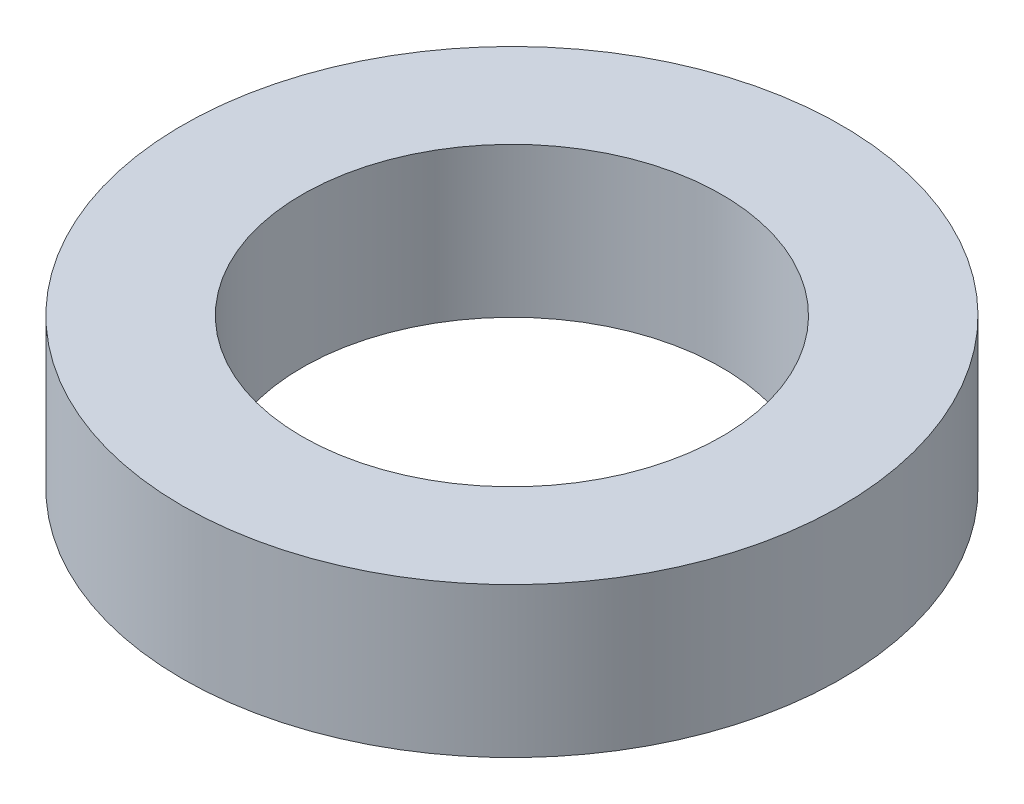
ISO-10303-21;
HEADER;
FILE_DESCRIPTION(('STEP AP214'),'2;1');
FILE_NAME('part.step','',(''),(''),'','','');
FILE_SCHEMA(('AUTOMOTIVE_DESIGN { 1 0 10303 214 1 1 1 1 }'));
ENDSEC;
DATA;
#1=APPLICATION_CONTEXT('core data for automotive mechanical design processes');
#2=APPLICATION_PROTOCOL_DEFINITION('international standard','automotive_design',2000,#1);
#3=PRODUCT_CONTEXT('',#1,'mechanical');
#4=PRODUCT('Part','Part','',(#3));
#5=PRODUCT_RELATED_PRODUCT_CATEGORY('part','',(#4));
#6=PRODUCT_DEFINITION_FORMATION('','',#4);
#7=PRODUCT_DEFINITION_CONTEXT('part definition',#1,'design');
#8=PRODUCT_DEFINITION('design','',#6,#7);
#9=PRODUCT_DEFINITION_SHAPE('','',#8);
#10=(LENGTH_UNIT() NAMED_UNIT(*) SI_UNIT(.MILLI.,.METRE.));
#11=(NAMED_UNIT(*) PLANE_ANGLE_UNIT() SI_UNIT($,.RADIAN.));
#12=(NAMED_UNIT(*) SI_UNIT($,.STERADIAN.) SOLID_ANGLE_UNIT());
#13=UNCERTAINTY_MEASURE_WITH_UNIT(LENGTH_MEASURE(1.E-05),#10,'distance_accuracy_value','');
#14=(GEOMETRIC_REPRESENTATION_CONTEXT(3) GLOBAL_UNCERTAINTY_ASSIGNED_CONTEXT((#13)) GLOBAL_UNIT_ASSIGNED_CONTEXT((#10,
#11,#12)) REPRESENTATION_CONTEXT('',''));
#15=CARTESIAN_POINT('',(0.,0.,0.));
#16=DIRECTION('',(0.,0.,1.));
#17=DIRECTION('',(1.,0.,0.));
#18=AXIS2_PLACEMENT_3D('',#15,#16,#17);
#19=CARTESIAN_POINT('',(0.,2.5,0.));
#20=DIRECTION('',(0.,1.,0.));
#21=DIRECTION('',(0.,0.,1.));
#22=AXIS2_PLACEMENT_3D('',#19,#20,#21);
#23=PLANE('',#22);
#24=CARTESIAN_POINT('',(0.,2.5,0.));
#25=DIRECTION('',(0.,1.,0.));
#26=DIRECTION('',(0.,0.,1.));
#27=AXIS2_PLACEMENT_3D('',#24,#25,#26);
#28=CIRCLE('',#27,5.5);
#29=CARTESIAN_POINT('',(0.,2.5,5.5));
#30=VERTEX_POINT('',#29);
#31=EDGE_CURVE('E10',#30,#30,#28,.T.);
#32=ORIENTED_EDGE('',*,*,#31,.T.);
#33=EDGE_LOOP('',(#32));
#34=FACE_BOUND('',#33,.T.);
#35=CARTESIAN_POINT('',(0.,2.5,0.));
#36=DIRECTION('',(0.,1.,0.));
#37=DIRECTION('',(0.,0.,1.));
#38=AXIS2_PLACEMENT_3D('',#35,#36,#37);
#39=CIRCLE('',#38,3.5);
#40=CARTESIAN_POINT('',(0.,2.5,3.5));
#41=VERTEX_POINT('',#40);
#42=EDGE_CURVE('E50',#41,#41,#39,.T.);
#43=ORIENTED_EDGE('',*,*,#42,.F.);
#44=EDGE_LOOP('',(#43));
#45=FACE_BOUND('',#44,.T.);
#46=ADVANCED_FACE('F37',(#34,#45),#23,.T.);
#47=CARTESIAN_POINT('',(0.,0.,0.));
#48=DIRECTION('',(0.,1.,0.));
#49=DIRECTION('',(0.,0.,1.));
#50=AXIS2_PLACEMENT_3D('',#47,#48,#49);
#51=PLANE('',#50);
#52=CARTESIAN_POINT('',(0.,0.,0.));
#53=DIRECTION('',(0.,1.,0.));
#54=DIRECTION('',(0.,0.,1.));
#55=AXIS2_PLACEMENT_3D('',#52,#53,#54);
#56=CIRCLE('',#55,5.5);
#57=CARTESIAN_POINT('',(0.,0.,5.5));
#58=VERTEX_POINT('',#57);
#59=EDGE_CURVE('E41',#58,#58,#56,.T.);
#60=ORIENTED_EDGE('',*,*,#59,.F.);
#61=EDGE_LOOP('',(#60));
#62=FACE_BOUND('',#61,.T.);
#63=CARTESIAN_POINT('',(0.,0.,0.));
#64=DIRECTION('',(0.,1.,0.));
#65=DIRECTION('',(0.,0.,1.));
#66=AXIS2_PLACEMENT_3D('',#63,#64,#65);
#67=CIRCLE('',#66,3.5);
#68=CARTESIAN_POINT('',(0.,0.,3.5));
#69=VERTEX_POINT('',#68);
#70=EDGE_CURVE('E52',#69,#69,#67,.T.);
#71=ORIENTED_EDGE('',*,*,#70,.T.);
#72=EDGE_LOOP('',(#71));
#73=FACE_BOUND('',#72,.T.);
#74=ADVANCED_FACE('F64',(#62,#73),#51,.F.);
#75=CARTESIAN_POINT('',(0.,2.5,0.));
#76=DIRECTION('',(0.,-1.,0.));
#77=DIRECTION('',(0.,0.,-1.));
#78=AXIS2_PLACEMENT_3D('',#75,#76,#77);
#79=CYLINDRICAL_SURFACE('',#78,5.5);
#80=ORIENTED_EDGE('',*,*,#31,.F.);
#81=EDGE_LOOP('',(#80));
#82=FACE_BOUND('',#81,.T.);
#83=ORIENTED_EDGE('',*,*,#59,.T.);
#84=EDGE_LOOP('',(#83));
#85=FACE_BOUND('',#84,.T.);
#86=ADVANCED_FACE('F39',(#82,#85),#79,.T.);
#87=CARTESIAN_POINT('',(0.,2.5,0.));
#88=DIRECTION('',(0.,-1.,0.));
#89=DIRECTION('',(0.,0.,-1.));
#90=AXIS2_PLACEMENT_3D('',#87,#88,#89);
#91=CYLINDRICAL_SURFACE('',#90,3.5);
#92=ORIENTED_EDGE('',*,*,#42,.T.);
#93=EDGE_LOOP('',(#92));
#94=FACE_BOUND('',#93,.T.);
#95=ORIENTED_EDGE('',*,*,#70,.F.);
#96=EDGE_LOOP('',(#95));
#97=FACE_BOUND('',#96,.T.);
#98=ADVANCED_FACE('F60',(#94,#97),#91,.F.);
#99=CLOSED_SHELL('',(#46,#74,#86,#98));
#100=MANIFOLD_SOLID_BREP('B2',#99);
#101=ADVANCED_BREP_SHAPE_REPRESENTATION('',(#18,#100),#14);
#102=SHAPE_DEFINITION_REPRESENTATION(#9,#101);
ENDSEC;
END-ISO-10303-21;
